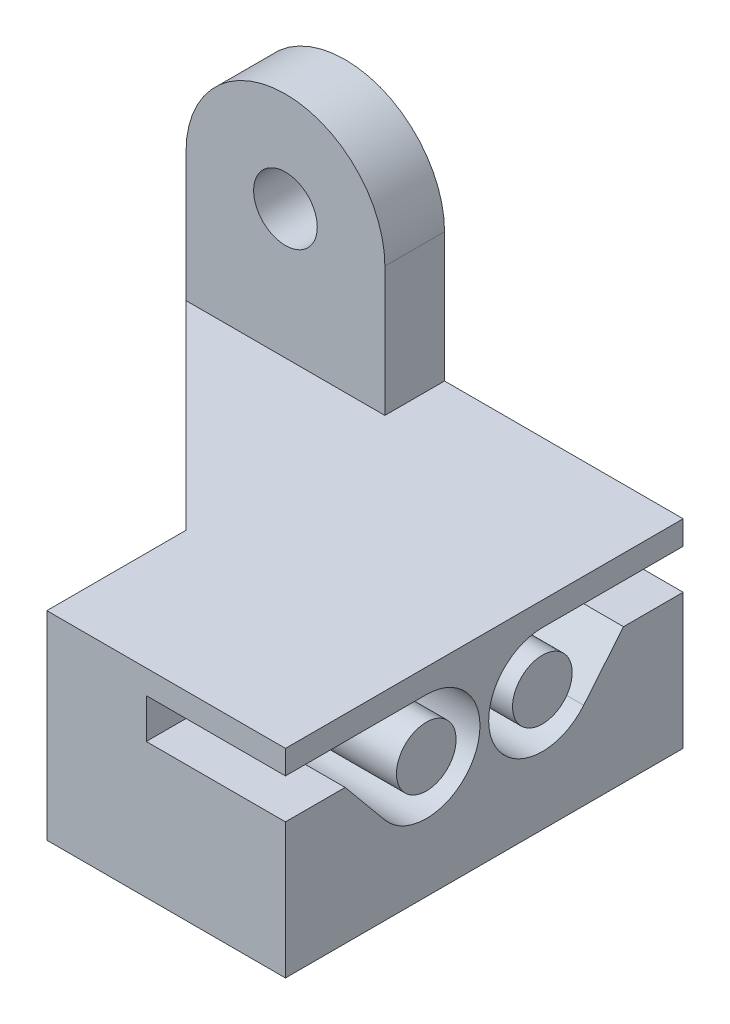
ISO-10303-21;
HEADER;
FILE_DESCRIPTION(('STEP AP214'),'2;1');
FILE_NAME('part.step','',(''),(''),'','','');
FILE_SCHEMA(('AUTOMOTIVE_DESIGN { 1 0 10303 214 1 1 1 1 }'));
ENDSEC;
DATA;
#1=APPLICATION_CONTEXT('core data for automotive mechanical design processes');
#2=APPLICATION_PROTOCOL_DEFINITION('international standard','automotive_design',2000,#1);
#3=PRODUCT_CONTEXT('',#1,'mechanical');
#4=PRODUCT('Part','Part','',(#3));
#5=PRODUCT_RELATED_PRODUCT_CATEGORY('part','',(#4));
#6=PRODUCT_DEFINITION_FORMATION('','',#4);
#7=PRODUCT_DEFINITION_CONTEXT('part definition',#1,'design');
#8=PRODUCT_DEFINITION('design','',#6,#7);
#9=PRODUCT_DEFINITION_SHAPE('','',#8);
#10=(LENGTH_UNIT() NAMED_UNIT(*) SI_UNIT(.MILLI.,.METRE.));
#11=(NAMED_UNIT(*) PLANE_ANGLE_UNIT() SI_UNIT($,.RADIAN.));
#12=(NAMED_UNIT(*) SI_UNIT($,.STERADIAN.) SOLID_ANGLE_UNIT());
#13=UNCERTAINTY_MEASURE_WITH_UNIT(LENGTH_MEASURE(1.E-05),#10,'distance_accuracy_value','');
#14=(GEOMETRIC_REPRESENTATION_CONTEXT(3) GLOBAL_UNCERTAINTY_ASSIGNED_CONTEXT((#13)) GLOBAL_UNIT_ASSIGNED_CONTEXT((#10,
#11,#12)) REPRESENTATION_CONTEXT('',''));
#15=CARTESIAN_POINT('',(0.,0.,0.));
#16=DIRECTION('',(0.,0.,1.));
#17=DIRECTION('',(1.,0.,0.));
#18=AXIS2_PLACEMENT_3D('',#15,#16,#17);
#19=CARTESIAN_POINT('',(0.,12.5,3.));
#20=DIRECTION('',(0.,0.,1.));
#21=DIRECTION('',(1.,0.,0.));
#22=AXIS2_PLACEMENT_3D('',#19,#20,#21);
#23=PLANE('',#22);
#24=CARTESIAN_POINT('',(0.,-12.5,3.));
#25=DIRECTION('',(0.,0.,1.));
#26=DIRECTION('',(1.,0.,0.));
#27=AXIS2_PLACEMENT_3D('',#24,#25,#26);
#28=CIRCLE('',#27,1.6);
#29=CARTESIAN_POINT('',(1.59999999999999,-12.5,3.));
#30=VERTEX_POINT('',#29);
#31=EDGE_CURVE('E276',#30,#30,#28,.T.);
#32=ORIENTED_EDGE('',*,*,#31,.F.);
#33=EDGE_LOOP('',(#32));
#34=FACE_BOUND('',#33,.T.);
#35=DIRECTION('',(0.,-1.,0.));
#36=VECTOR('',#35,1.);
#37=CARTESIAN_POINT('',(4.99999999999999,-18.1062696711217,3.));
#38=LINE('',#37,#36);
#39=CARTESIAN_POINT('',(4.99999999999999,-4.,3.));
#40=VERTEX_POINT('',#39);
#41=CARTESIAN_POINT('',(4.99999999999999,-12.5,3.));
#42=VERTEX_POINT('',#41);
#43=EDGE_CURVE('E269',#40,#42,#38,.T.);
#44=ORIENTED_EDGE('',*,*,#43,.F.);
#45=DIRECTION('',(-1.,0.,0.));
#46=VECTOR('',#45,1.);
#47=CARTESIAN_POINT('',(0.,-4.,3.));
#48=LINE('',#47,#46);
#49=CARTESIAN_POINT('',(-4.99999999999999,-4.,3.));
#50=VERTEX_POINT('',#49);
#51=EDGE_CURVE('E353',#40,#50,#48,.T.);
#52=ORIENTED_EDGE('',*,*,#51,.T.);
#53=DIRECTION('',(0.,1.,0.));
#54=VECTOR('',#53,1.);
#55=CARTESIAN_POINT('',(-4.99999999999999,-18.1062696711217,3.));
#56=LINE('',#55,#54);
#57=CARTESIAN_POINT('',(-4.99999999999999,-12.5,3.));
#58=VERTEX_POINT('',#57);
#59=EDGE_CURVE('E266',#58,#50,#56,.T.);
#60=ORIENTED_EDGE('',*,*,#59,.F.);
#61=CARTESIAN_POINT('',(0.,-12.5,3.));
#62=DIRECTION('',(0.,0.,1.));
#63=DIRECTION('',(1.,0.,0.));
#64=AXIS2_PLACEMENT_3D('',#61,#62,#63);
#65=CIRCLE('',#64,5.);
#66=EDGE_CURVE('E279',#58,#42,#65,.T.);
#67=ORIENTED_EDGE('',*,*,#66,.T.);
#68=EDGE_LOOP('',(#44,#52,#60,#67));
#69=FACE_BOUND('',#68,.T.);
#70=ADVANCED_FACE('F34',(#34,#69),#23,.T.);
#71=CARTESIAN_POINT('',(0.,12.5,20.));
#72=DIRECTION('',(0.,0.,-1.));
#73=DIRECTION('',(-1.,0.,0.));
#74=AXIS2_PLACEMENT_3D('',#71,#72,#73);
#75=CYLINDRICAL_SURFACE('',#74,5.);
#76=CARTESIAN_POINT('',(0.,12.5,3.));
#77=DIRECTION('',(0.,0.,1.));
#78=DIRECTION('',(1.,0.,0.));
#79=AXIS2_PLACEMENT_3D('',#76,#77,#78);
#80=CIRCLE('',#79,5.);
#81=CARTESIAN_POINT('',(4.99999999999999,12.5,3.));
#82=VERTEX_POINT('',#81);
#83=CARTESIAN_POINT('',(-4.99999999999999,12.5,3.));
#84=VERTEX_POINT('',#83);
#85=EDGE_CURVE('E282',#82,#84,#80,.T.);
#86=ORIENTED_EDGE('',*,*,#85,.F.);
#87=DIRECTION('',(0.,0.,-1.));
#88=VECTOR('',#87,1.);
#89=CARTESIAN_POINT('',(5.,12.5,20.));
#90=LINE('',#89,#88);
#91=CARTESIAN_POINT('',(5.,12.5,0.));
#92=VERTEX_POINT('',#91);
#93=EDGE_CURVE('E302',#82,#92,#90,.T.);
#94=ORIENTED_EDGE('',*,*,#93,.T.);
#95=CARTESIAN_POINT('',(0.,12.5,0.));
#96=DIRECTION('',(0.,0.,1.));
#97=DIRECTION('',(1.,0.,0.));
#98=AXIS2_PLACEMENT_3D('',#95,#96,#97);
#99=CIRCLE('',#98,5.);
#100=CARTESIAN_POINT('',(-5.,12.5,0.));
#101=VERTEX_POINT('',#100);
#102=EDGE_CURVE('E291',#92,#101,#99,.T.);
#103=ORIENTED_EDGE('',*,*,#102,.T.);
#104=DIRECTION('',(0.,0.,-1.));
#105=VECTOR('',#104,1.);
#106=CARTESIAN_POINT('',(-5.,12.5,20.));
#107=LINE('',#106,#105);
#108=EDGE_CURVE('E344',#84,#101,#107,.T.);
#109=ORIENTED_EDGE('',*,*,#108,.F.);
#110=EDGE_LOOP('',(#86,#94,#103,#109));
#111=FACE_BOUND('',#110,.T.);
#112=ADVANCED_FACE('F379',(#111),#75,.T.);
#113=CARTESIAN_POINT('',(-5.,12.5,20.));
#114=DIRECTION('',(1.,0.,0.));
#115=DIRECTION('',(0.,1.,0.));
#116=AXIS2_PLACEMENT_3D('',#113,#114,#115);
#117=PLANE('',#116);
#118=ORIENTED_EDGE('',*,*,#59,.T.);
#119=CARTESIAN_POINT('',(-4.99999999999999,6.,3.));
#120=VERTEX_POINT('',#119);
#121=EDGE_CURVE('E270',#50,#120,#56,.T.);
#122=ORIENTED_EDGE('',*,*,#121,.T.);
#123=EDGE_CURVE('E271',#120,#84,#56,.T.);
#124=ORIENTED_EDGE('',*,*,#123,.T.);
#125=ORIENTED_EDGE('',*,*,#108,.T.);
#126=DIRECTION('',(0.,-1.,0.));
#127=VECTOR('',#126,1.);
#128=CARTESIAN_POINT('',(-5.,12.5,0.));
#129=LINE('',#128,#127);
#130=CARTESIAN_POINT('',(-5.00000000000001,-12.5,0.));
#131=VERTEX_POINT('',#130);
#132=EDGE_CURVE('E305',#101,#131,#129,.T.);
#133=ORIENTED_EDGE('',*,*,#132,.T.);
#134=DIRECTION('',(0.,0.,-1.));
#135=VECTOR('',#134,1.);
#136=CARTESIAN_POINT('',(-5.00000000000001,-12.5,20.));
#137=LINE('',#136,#135);
#138=EDGE_CURVE('E342',#58,#131,#137,.T.);
#139=ORIENTED_EDGE('',*,*,#138,.F.);
#140=EDGE_LOOP('',(#118,#122,#124,#125,#133,#139));
#141=FACE_BOUND('',#140,.T.);
#142=ADVANCED_FACE('F368',(#141),#117,.F.);
#143=CARTESIAN_POINT('',(0.,-12.5,20.));
#144=DIRECTION('',(0.,0.,-1.));
#145=DIRECTION('',(-1.,0.,0.));
#146=AXIS2_PLACEMENT_3D('',#143,#144,#145);
#147=CYLINDRICAL_SURFACE('',#146,5.);
#148=ORIENTED_EDGE('',*,*,#66,.F.);
#149=ORIENTED_EDGE('',*,*,#138,.T.);
#150=CARTESIAN_POINT('',(0.,-12.5,0.));
#151=DIRECTION('',(0.,0.,1.));
#152=DIRECTION('',(1.,0.,0.));
#153=AXIS2_PLACEMENT_3D('',#150,#151,#152);
#154=CIRCLE('',#153,5.);
#155=CARTESIAN_POINT('',(5.,-12.5,0.));
#156=VERTEX_POINT('',#155);
#157=EDGE_CURVE('E308',#131,#156,#154,.T.);
#158=ORIENTED_EDGE('',*,*,#157,.T.);
#159=DIRECTION('',(0.,0.,-1.));
#160=VECTOR('',#159,1.);
#161=CARTESIAN_POINT('',(5.,-12.5,20.));
#162=LINE('',#161,#160);
#163=EDGE_CURVE('E340',#42,#156,#162,.T.);
#164=ORIENTED_EDGE('',*,*,#163,.F.);
#165=EDGE_LOOP('',(#148,#149,#158,#164));
#166=FACE_BOUND('',#165,.T.);
#167=ADVANCED_FACE('F392',(#166),#147,.T.);
#168=CARTESIAN_POINT('',(4.99999999999999,-4.,20.));
#169=DIRECTION('',(-1.,0.,0.));
#170=DIRECTION('',(0.,-1.,0.));
#171=AXIS2_PLACEMENT_3D('',#168,#169,#170);
#172=PLANE('',#171);
#173=ORIENTED_EDGE('',*,*,#43,.T.);
#174=ORIENTED_EDGE('',*,*,#163,.T.);
#175=DIRECTION('',(0.,1.,0.));
#176=VECTOR('',#175,1.);
#177=CARTESIAN_POINT('',(4.99999999999999,-4.,0.));
#178=LINE('',#177,#176);
#179=CARTESIAN_POINT('',(4.99999999999999,-4.,0.));
#180=VERTEX_POINT('',#179);
#181=EDGE_CURVE('E311',#156,#180,#178,.T.);
#182=ORIENTED_EDGE('',*,*,#181,.T.);
#183=DIRECTION('',(0.,0.,-1.));
#184=VECTOR('',#183,1.);
#185=CARTESIAN_POINT('',(4.99999999999999,-4.,20.));
#186=LINE('',#185,#184);
#187=EDGE_CURVE('E336',#40,#180,#186,.T.);
#188=ORIENTED_EDGE('',*,*,#187,.F.);
#189=EDGE_LOOP('',(#173,#174,#182,#188));
#190=FACE_BOUND('',#189,.T.);
#191=ADVANCED_FACE('F394',(#190),#172,.F.);
#192=CARTESIAN_POINT('',(5.,12.5,20.));
#193=DIRECTION('',(-1.,0.,0.));
#194=DIRECTION('',(0.,-1.,0.));
#195=AXIS2_PLACEMENT_3D('',#192,#193,#194);
#196=PLANE('',#195);
#197=CARTESIAN_POINT('',(4.99999999999999,6.,3.));
#198=VERTEX_POINT('',#197);
#199=EDGE_CURVE('E274',#82,#198,#38,.T.);
#200=ORIENTED_EDGE('',*,*,#199,.T.);
#201=DIRECTION('',(0.,0.,-1.));
#202=VECTOR('',#201,1.);
#203=CARTESIAN_POINT('',(4.99999999999999,6.,20.));
#204=LINE('',#203,#202);
#205=CARTESIAN_POINT('',(4.99999999999999,6.,0.));
#206=VERTEX_POINT('',#205);
#207=EDGE_CURVE('E326',#198,#206,#204,.T.);
#208=ORIENTED_EDGE('',*,*,#207,.T.);
#209=DIRECTION('',(0.,1.,0.));
#210=VECTOR('',#209,1.);
#211=CARTESIAN_POINT('',(5.,12.5,0.));
#212=LINE('',#211,#210);
#213=EDGE_CURVE('E295',#206,#92,#212,.T.);
#214=ORIENTED_EDGE('',*,*,#213,.T.);
#215=ORIENTED_EDGE('',*,*,#93,.F.);
#216=EDGE_LOOP('',(#200,#208,#214,#215));
#217=FACE_BOUND('',#216,.T.);
#218=ADVANCED_FACE('F459',(#217),#196,.F.);
#219=CARTESIAN_POINT('',(0.,-12.5,20.));
#220=DIRECTION('',(0.,0.,-1.));
#221=DIRECTION('',(-1.,0.,0.));
#222=AXIS2_PLACEMENT_3D('',#219,#220,#221);
#223=CYLINDRICAL_SURFACE('',#222,1.6);
#224=CARTESIAN_POINT('',(0.,-12.5,0.));
#225=DIRECTION('',(0.,0.,1.));
#226=DIRECTION('',(1.,0.,0.));
#227=AXIS2_PLACEMENT_3D('',#224,#225,#226);
#228=CIRCLE('',#227,1.6);
#229=CARTESIAN_POINT('',(1.59999999999999,-12.5,0.));
#230=VERTEX_POINT('',#229);
#231=EDGE_CURVE('E288',#230,#230,#228,.T.);
#232=ORIENTED_EDGE('',*,*,#231,.F.);
#233=EDGE_LOOP('',(#232));
#234=FACE_BOUND('',#233,.T.);
#235=ORIENTED_EDGE('',*,*,#31,.T.);
#236=EDGE_LOOP('',(#235));
#237=FACE_BOUND('',#236,.T.);
#238=ADVANCED_FACE('F450',(#234,#237),#223,.F.);
#239=CARTESIAN_POINT('',(0.,12.5,20.));
#240=DIRECTION('',(0.,0.,-1.));
#241=DIRECTION('',(-1.,0.,0.));
#242=AXIS2_PLACEMENT_3D('',#239,#240,#241);
#243=CYLINDRICAL_SURFACE('',#242,1.6);
#244=CARTESIAN_POINT('',(0.,12.5,0.));
#245=DIRECTION('',(0.,0.,1.));
#246=DIRECTION('',(1.,0.,0.));
#247=AXIS2_PLACEMENT_3D('',#244,#245,#246);
#248=CIRCLE('',#247,1.6);
#249=CARTESIAN_POINT('',(1.59999999999999,12.5,0.));
#250=VERTEX_POINT('',#249);
#251=EDGE_CURVE('E285',#250,#250,#248,.T.);
#252=ORIENTED_EDGE('',*,*,#251,.F.);
#253=EDGE_LOOP('',(#252));
#254=FACE_BOUND('',#253,.T.);
#255=CARTESIAN_POINT('',(0.,12.5,3.));
#256=DIRECTION('',(0.,0.,1.));
#257=DIRECTION('',(1.,0.,0.));
#258=AXIS2_PLACEMENT_3D('',#255,#256,#257);
#259=CIRCLE('',#258,1.6);
#260=CARTESIAN_POINT('',(1.59999999999999,12.5,3.));
#261=VERTEX_POINT('',#260);
#262=EDGE_CURVE('E280',#261,#261,#259,.T.);
#263=ORIENTED_EDGE('',*,*,#262,.T.);
#264=EDGE_LOOP('',(#263));
#265=FACE_BOUND('',#264,.T.);
#266=ADVANCED_FACE('F447',(#254,#265),#243,.F.);
#267=CARTESIAN_POINT('',(0.,12.5,20.));
#268=DIRECTION('',(0.,0.,1.));
#269=DIRECTION('',(1.,0.,0.));
#270=AXIS2_PLACEMENT_3D('',#267,#268,#269);
#271=PLANE('',#270);
#272=DIRECTION('',(1.,0.,0.));
#273=VECTOR('',#272,1.);
#274=CARTESIAN_POINT('',(9.99999999999999,2.8,20.));
#275=LINE('',#274,#273);
#276=CARTESIAN_POINT('',(9.99999999999999,2.8,20.));
#277=VERTEX_POINT('',#276);
#278=CARTESIAN_POINT('',(17.,2.8,20.));
#279=VERTEX_POINT('',#278);
#280=EDGE_CURVE('E222',#277,#279,#275,.T.);
#281=ORIENTED_EDGE('',*,*,#280,.F.);
#282=DIRECTION('',(0.,-1.,0.));
#283=VECTOR('',#282,1.);
#284=CARTESIAN_POINT('',(9.99999999999999,4.8,20.));
#285=LINE('',#284,#283);
#286=CARTESIAN_POINT('',(9.99999999999999,4.8,20.));
#287=VERTEX_POINT('',#286);
#288=EDGE_CURVE('E193',#287,#277,#285,.T.);
#289=ORIENTED_EDGE('',*,*,#288,.F.);
#290=DIRECTION('',(1.,0.,0.));
#291=VECTOR('',#290,1.);
#292=CARTESIAN_POINT('',(9.99999999999999,4.8,20.));
#293=LINE('',#292,#291);
#294=CARTESIAN_POINT('',(17.,4.8,20.));
#295=VERTEX_POINT('',#294);
#296=EDGE_CURVE('E183',#287,#295,#293,.T.);
#297=ORIENTED_EDGE('',*,*,#296,.T.);
#298=DIRECTION('',(0.,1.,0.));
#299=VECTOR('',#298,1.);
#300=CARTESIAN_POINT('',(17.,-4.,20.));
#301=LINE('',#300,#299);
#302=CARTESIAN_POINT('',(17.,6.,20.));
#303=VERTEX_POINT('',#302);
#304=EDGE_CURVE('E294',#295,#303,#301,.T.);
#305=ORIENTED_EDGE('',*,*,#304,.T.);
#306=DIRECTION('',(-1.,0.,0.));
#307=VECTOR('',#306,1.);
#308=CARTESIAN_POINT('',(17.,6.,20.));
#309=LINE('',#308,#307);
#310=CARTESIAN_POINT('',(4.99999999999999,6.,20.));
#311=VERTEX_POINT('',#310);
#312=EDGE_CURVE('E299',#303,#311,#309,.T.);
#313=ORIENTED_EDGE('',*,*,#312,.T.);
#314=DIRECTION('',(0.,1.,0.));
#315=VECTOR('',#314,1.);
#316=CARTESIAN_POINT('',(4.99999999999999,-18.1062696711217,20.));
#317=LINE('',#316,#315);
#318=CARTESIAN_POINT('',(4.99999999999999,-4.,20.));
#319=VERTEX_POINT('',#318);
#320=EDGE_CURVE('E258',#319,#311,#317,.T.);
#321=ORIENTED_EDGE('',*,*,#320,.F.);
#322=DIRECTION('',(1.,0.,0.));
#323=VECTOR('',#322,1.);
#324=CARTESIAN_POINT('',(4.99999999999999,-4.,20.));
#325=LINE('',#324,#323);
#326=CARTESIAN_POINT('',(17.,-4.,20.));
#327=VERTEX_POINT('',#326);
#328=EDGE_CURVE('E292',#319,#327,#325,.T.);
#329=ORIENTED_EDGE('',*,*,#328,.T.);
#330=EDGE_CURVE('E296',#327,#279,#301,.T.);
#331=ORIENTED_EDGE('',*,*,#330,.T.);
#332=EDGE_LOOP('',(#281,#289,#297,#305,#313,#321,#329,#331));
#333=FACE_BOUND('',#332,.T.);
#334=ADVANCED_FACE('F449',(#333),#271,.T.);
#335=CARTESIAN_POINT('',(0.,12.5,0.));
#336=DIRECTION('',(0.,0.,1.));
#337=DIRECTION('',(1.,0.,0.));
#338=AXIS2_PLACEMENT_3D('',#335,#336,#337);
#339=PLANE('',#338);
#340=DIRECTION('',(0.,1.,0.));
#341=VECTOR('',#340,1.);
#342=CARTESIAN_POINT('',(9.99999999999999,4.8,0.));
#343=LINE('',#342,#341);
#344=CARTESIAN_POINT('',(9.99999999999999,2.8,0.));
#345=VERTEX_POINT('',#344);
#346=CARTESIAN_POINT('',(9.99999999999999,4.8,0.));
#347=VERTEX_POINT('',#346);
#348=EDGE_CURVE('E231',#345,#347,#343,.T.);
#349=ORIENTED_EDGE('',*,*,#348,.F.);
#350=DIRECTION('',(1.,0.,0.));
#351=VECTOR('',#350,1.);
#352=CARTESIAN_POINT('',(9.99999999999999,2.8,0.));
#353=LINE('',#352,#351);
#354=CARTESIAN_POINT('',(17.,2.8,0.));
#355=VERTEX_POINT('',#354);
#356=EDGE_CURVE('E255',#345,#355,#353,.T.);
#357=ORIENTED_EDGE('',*,*,#356,.T.);
#358=DIRECTION('',(0.,1.,0.));
#359=VECTOR('',#358,1.);
#360=CARTESIAN_POINT('',(17.,-4.,0.));
#361=LINE('',#360,#359);
#362=CARTESIAN_POINT('',(17.,-4.,0.));
#363=VERTEX_POINT('',#362);
#364=EDGE_CURVE('E317',#363,#355,#361,.T.);
#365=ORIENTED_EDGE('',*,*,#364,.F.);
#366=DIRECTION('',(1.,0.,0.));
#367=VECTOR('',#366,1.);
#368=CARTESIAN_POINT('',(4.99999999999999,-4.,0.));
#369=LINE('',#368,#367);
#370=EDGE_CURVE('E314',#180,#363,#369,.T.);
#371=ORIENTED_EDGE('',*,*,#370,.F.);
#372=ORIENTED_EDGE('',*,*,#181,.F.);
#373=ORIENTED_EDGE('',*,*,#157,.F.);
#374=ORIENTED_EDGE('',*,*,#132,.F.);
#375=ORIENTED_EDGE('',*,*,#102,.F.);
#376=ORIENTED_EDGE('',*,*,#213,.F.);
#377=DIRECTION('',(-1.,0.,0.));
#378=VECTOR('',#377,1.);
#379=CARTESIAN_POINT('',(17.,6.,0.));
#380=LINE('',#379,#378);
#381=CARTESIAN_POINT('',(17.,6.,0.));
#382=VERTEX_POINT('',#381);
#383=EDGE_CURVE('E320',#382,#206,#380,.T.);
#384=ORIENTED_EDGE('',*,*,#383,.F.);
#385=CARTESIAN_POINT('',(17.,4.8,0.));
#386=VERTEX_POINT('',#385);
#387=EDGE_CURVE('E316',#386,#382,#361,.T.);
#388=ORIENTED_EDGE('',*,*,#387,.F.);
#389=DIRECTION('',(1.,0.,0.));
#390=VECTOR('',#389,1.);
#391=CARTESIAN_POINT('',(9.99999999999999,4.8,0.));
#392=LINE('',#391,#390);
#393=EDGE_CURVE('E57',#347,#386,#392,.T.);
#394=ORIENTED_EDGE('',*,*,#393,.F.);
#395=EDGE_LOOP('',(#349,#357,#365,#371,#372,#373,#374,#375,#376,#384,#388,#394));
#396=FACE_BOUND('',#395,.T.);
#397=ORIENTED_EDGE('',*,*,#231,.T.);
#398=EDGE_LOOP('',(#397));
#399=FACE_BOUND('',#398,.T.);
#400=ORIENTED_EDGE('',*,*,#251,.T.);
#401=EDGE_LOOP('',(#400));
#402=FACE_BOUND('',#401,.T.);
#403=ADVANCED_FACE('F384',(#396,#399,#402),#339,.F.);
#404=CARTESIAN_POINT('',(4.99999999999999,-4.,20.));
#405=DIRECTION('',(0.,1.,0.));
#406=DIRECTION('',(0.,0.,1.));
#407=AXIS2_PLACEMENT_3D('',#404,#405,#406);
#408=PLANE('',#407);
#409=ORIENTED_EDGE('',*,*,#370,.T.);
#410=DIRECTION('',(0.,0.,-1.));
#411=VECTOR('',#410,1.);
#412=CARTESIAN_POINT('',(17.,-4.,20.));
#413=LINE('',#412,#411);
#414=EDGE_CURVE('E333',#327,#363,#413,.T.);
#415=ORIENTED_EDGE('',*,*,#414,.F.);
#416=ORIENTED_EDGE('',*,*,#328,.F.);
#417=CARTESIAN_POINT('',(4.99999999999999,-4.,13.0000000000001));
#418=VERTEX_POINT('',#417);
#419=EDGE_CURVE('E337',#319,#418,#186,.T.);
#420=ORIENTED_EDGE('',*,*,#419,.T.);
#421=DIRECTION('',(-0.707106781186544,0.,-0.707106781186552));
#422=VECTOR('',#421,1.);
#423=CARTESIAN_POINT('',(8.49999999999996,-4.,16.5000000000001));
#424=LINE('',#423,#422);
#425=EDGE_CURVE('E42',#418,#50,#424,.T.);
#426=ORIENTED_EDGE('',*,*,#425,.T.);
#427=ORIENTED_EDGE('',*,*,#51,.F.);
#428=ORIENTED_EDGE('',*,*,#187,.T.);
#429=EDGE_LOOP('',(#409,#415,#416,#420,#426,#427,#428));
#430=FACE_BOUND('',#429,.T.);
#431=ADVANCED_FACE('F356',(#430),#408,.F.);
#432=CARTESIAN_POINT('',(17.,-4.,20.));
#433=DIRECTION('',(-1.,0.,0.));
#434=DIRECTION('',(0.,0.,1.));
#435=AXIS2_PLACEMENT_3D('',#432,#433,#434);
#436=PLANE('',#435);
#437=DIRECTION('',(0.,-0.770827950138104,-0.637043382577583));
#438=VECTOR('',#437,1.);
#439=CARTESIAN_POINT('',(17.,0.379982867040524,15.));
#440=LINE('',#439,#438);
#441=CARTESIAN_POINT('',(17.,2.8,17.));
#442=VERTEX_POINT('',#441);
#443=CARTESIAN_POINT('',(17.,0.379982867040524,15.));
#444=VERTEX_POINT('',#443);
#445=EDGE_CURVE('E198',#442,#444,#440,.T.);
#446=ORIENTED_EDGE('',*,*,#445,.F.);
#447=DIRECTION('',(0.,0.,-1.));
#448=VECTOR('',#447,1.);
#449=CARTESIAN_POINT('',(17.,2.8,17.));
#450=LINE('',#449,#448);
#451=EDGE_CURVE('E201',#279,#442,#450,.T.);
#452=ORIENTED_EDGE('',*,*,#451,.F.);
#453=ORIENTED_EDGE('',*,*,#330,.F.);
#454=ORIENTED_EDGE('',*,*,#414,.T.);
#455=ORIENTED_EDGE('',*,*,#364,.T.);
#456=DIRECTION('',(0.,0.,-1.));
#457=VECTOR('',#456,1.);
#458=CARTESIAN_POINT('',(17.,2.8,3.));
#459=LINE('',#458,#457);
#460=CARTESIAN_POINT('',(17.,2.8,3.));
#461=VERTEX_POINT('',#460);
#462=EDGE_CURVE('E235',#461,#355,#459,.T.);
#463=ORIENTED_EDGE('',*,*,#462,.F.);
#464=DIRECTION('',(0.,0.770827950138104,-0.637043382577583));
#465=VECTOR('',#464,1.);
#466=CARTESIAN_POINT('',(17.,0.379982867040525,5.));
#467=LINE('',#466,#465);
#468=CARTESIAN_POINT('',(17.,0.379982867040526,5.));
#469=VERTEX_POINT('',#468);
#470=EDGE_CURVE('E251',#469,#461,#467,.T.);
#471=ORIENTED_EDGE('',*,*,#470,.F.);
#472=CARTESIAN_POINT('',(17.,2.1,7.08123546537288));
#473=DIRECTION('',(1.,0.,0.));
#474=DIRECTION('',(0.,0.,-1.));
#475=AXIS2_PLACEMENT_3D('',#472,#473,#474);
#476=CIRCLE('',#475,2.7);
#477=CARTESIAN_POINT('',(17.,4.8,7.08123546537288));
#478=VERTEX_POINT('',#477);
#479=EDGE_CURVE('E248',#478,#469,#476,.T.);
#480=ORIENTED_EDGE('',*,*,#479,.F.);
#481=DIRECTION('',(0.,0.,1.));
#482=VECTOR('',#481,1.);
#483=CARTESIAN_POINT('',(17.,4.8,0.));
#484=LINE('',#483,#482);
#485=EDGE_CURVE('E228',#386,#478,#484,.T.);
#486=ORIENTED_EDGE('',*,*,#485,.F.);
#487=ORIENTED_EDGE('',*,*,#387,.T.);
#488=DIRECTION('',(0.,0.,-1.));
#489=VECTOR('',#488,1.);
#490=CARTESIAN_POINT('',(17.,6.,20.));
#491=LINE('',#490,#489);
#492=EDGE_CURVE('E330',#303,#382,#491,.T.);
#493=ORIENTED_EDGE('',*,*,#492,.F.);
#494=ORIENTED_EDGE('',*,*,#304,.F.);
#495=DIRECTION('',(0.,0.,1.));
#496=VECTOR('',#495,1.);
#497=CARTESIAN_POINT('',(17.,4.8,20.));
#498=LINE('',#497,#496);
#499=CARTESIAN_POINT('',(17.,4.8,12.9187645346271));
#500=VERTEX_POINT('',#499);
#501=EDGE_CURVE('E212',#500,#295,#498,.T.);
#502=ORIENTED_EDGE('',*,*,#501,.F.);
#503=CARTESIAN_POINT('',(17.,2.1,12.9187645346271));
#504=DIRECTION('',(1.,0.,0.));
#505=DIRECTION('',(0.,0.,1.));
#506=AXIS2_PLACEMENT_3D('',#503,#504,#505);
#507=CIRCLE('',#506,2.7);
#508=EDGE_CURVE('E49',#444,#500,#507,.T.);
#509=ORIENTED_EDGE('',*,*,#508,.F.);
#510=EDGE_LOOP('',(#446,#452,#453,#454,#455,#463,#471,#480,#486,#487,#493,#494,#502,#509));
#511=FACE_BOUND('',#510,.T.);
#512=ADVANCED_FACE('F400',(#511),#436,.F.);
#513=CARTESIAN_POINT('',(17.,6.,20.));
#514=DIRECTION('',(0.,-1.,0.));
#515=DIRECTION('',(1.,0.,0.));
#516=AXIS2_PLACEMENT_3D('',#513,#514,#515);
#517=PLANE('',#516);
#518=ORIENTED_EDGE('',*,*,#383,.T.);
#519=ORIENTED_EDGE('',*,*,#207,.F.);
#520=DIRECTION('',(1.,0.,0.));
#521=VECTOR('',#520,1.);
#522=CARTESIAN_POINT('',(0.,6.,3.));
#523=LINE('',#522,#521);
#524=EDGE_CURVE('E351',#120,#198,#523,.T.);
#525=ORIENTED_EDGE('',*,*,#524,.F.);
#526=DIRECTION('',(0.707106781186544,0.,0.707106781186552));
#527=VECTOR('',#526,1.);
#528=CARTESIAN_POINT('',(14.4999999999999,6.,22.5000000000001));
#529=LINE('',#528,#527);
#530=CARTESIAN_POINT('',(4.99999999999999,6.,13.0000000000001));
#531=VERTEX_POINT('',#530);
#532=EDGE_CURVE('E12',#120,#531,#529,.T.);
#533=ORIENTED_EDGE('',*,*,#532,.T.);
#534=EDGE_CURVE('E327',#311,#531,#204,.T.);
#535=ORIENTED_EDGE('',*,*,#534,.F.);
#536=ORIENTED_EDGE('',*,*,#312,.F.);
#537=ORIENTED_EDGE('',*,*,#492,.T.);
#538=EDGE_LOOP('',(#518,#519,#525,#533,#535,#536,#537));
#539=FACE_BOUND('',#538,.T.);
#540=ADVANCED_FACE('F443',(#539),#517,.F.);
#541=CARTESIAN_POINT('',(4.99999999999999,-18.1062696711217,-37.567911914472));
#542=DIRECTION('',(1.,0.,0.));
#543=DIRECTION('',(0.,0.,-1.));
#544=AXIS2_PLACEMENT_3D('',#541,#542,#543);
#545=PLANE('',#544);
#546=ORIENTED_EDGE('',*,*,#534,.T.);
#547=DIRECTION('',(0.,-1.,0.));
#548=VECTOR('',#547,1.);
#549=CARTESIAN_POINT('',(4.99999999999999,-18.1062696711217,13.0000000000001));
#550=LINE('',#549,#548);
#551=EDGE_CURVE('E346',#531,#418,#550,.T.);
#552=ORIENTED_EDGE('',*,*,#551,.T.);
#553=ORIENTED_EDGE('',*,*,#419,.F.);
#554=ORIENTED_EDGE('',*,*,#320,.T.);
#555=EDGE_LOOP('',(#546,#552,#553,#554));
#556=FACE_BOUND('',#555,.T.);
#557=ADVANCED_FACE('F437',(#556),#545,.F.);
#558=ORIENTED_EDGE('',*,*,#262,.F.);
#559=EDGE_LOOP('',(#558));
#560=FACE_BOUND('',#559,.T.);
#561=ORIENTED_EDGE('',*,*,#123,.F.);
#562=ORIENTED_EDGE('',*,*,#524,.T.);
#563=ORIENTED_EDGE('',*,*,#199,.F.);
#564=ORIENTED_EDGE('',*,*,#85,.T.);
#565=EDGE_LOOP('',(#561,#562,#563,#564));
#566=FACE_BOUND('',#565,.T.);
#567=ADVANCED_FACE('F375',(#560,#566),#23,.T.);
#568=CARTESIAN_POINT('',(4.99999999999999,-18.1062696711217,13.0000000000001));
#569=DIRECTION('',(0.707106781186552,0.,-0.707106781186544));
#570=DIRECTION('',(0.,-1.,0.));
#571=AXIS2_PLACEMENT_3D('',#568,#569,#570);
#572=PLANE('',#571);
#573=ORIENTED_EDGE('',*,*,#532,.F.);
#574=ORIENTED_EDGE('',*,*,#121,.F.);
#575=ORIENTED_EDGE('',*,*,#425,.F.);
#576=ORIENTED_EDGE('',*,*,#551,.F.);
#577=EDGE_LOOP('',(#573,#574,#575,#576));
#578=FACE_BOUND('',#577,.T.);
#579=ADVANCED_FACE('F36',(#578),#572,.F.);
#580=CARTESIAN_POINT('',(9.99999999999999,2.8,3.));
#581=DIRECTION('',(0.,-1.,0.));
#582=DIRECTION('',(0.,0.,-1.));
#583=AXIS2_PLACEMENT_3D('',#580,#581,#582);
#584=PLANE('',#583);
#585=ORIENTED_EDGE('',*,*,#462,.T.);
#586=ORIENTED_EDGE('',*,*,#356,.F.);
#587=DIRECTION('',(0.,0.,-1.));
#588=VECTOR('',#587,1.);
#589=CARTESIAN_POINT('',(9.99999999999999,2.8,3.));
#590=LINE('',#589,#588);
#591=CARTESIAN_POINT('',(9.99999999999999,2.8,3.));
#592=VERTEX_POINT('',#591);
#593=EDGE_CURVE('E244',#592,#345,#590,.T.);
#594=ORIENTED_EDGE('',*,*,#593,.F.);
#595=DIRECTION('',(1.,0.,0.));
#596=VECTOR('',#595,1.);
#597=CARTESIAN_POINT('',(9.99999999999999,2.8,3.));
#598=LINE('',#597,#596);
#599=EDGE_CURVE('E259',#592,#461,#598,.T.);
#600=ORIENTED_EDGE('',*,*,#599,.T.);
#601=EDGE_LOOP('',(#585,#586,#594,#600));
#602=FACE_BOUND('',#601,.T.);
#603=ADVANCED_FACE('F405',(#602),#584,.F.);
#604=CARTESIAN_POINT('',(9.99999999999999,0.379982867040525,5.));
#605=DIRECTION('',(0.,-0.637043382577583,-0.770827950138104));
#606=DIRECTION('',(0.,0.770827950138104,-0.637043382577583));
#607=AXIS2_PLACEMENT_3D('',#604,#605,#606);
#608=PLANE('',#607);
#609=ORIENTED_EDGE('',*,*,#470,.T.);
#610=ORIENTED_EDGE('',*,*,#599,.F.);
#611=DIRECTION('',(0.,0.770827950138104,-0.637043382577583));
#612=VECTOR('',#611,1.);
#613=CARTESIAN_POINT('',(9.99999999999999,0.379982867040525,5.));
#614=LINE('',#613,#612);
#615=CARTESIAN_POINT('',(9.99999999999999,0.379982867040526,5.));
#616=VERTEX_POINT('',#615);
#617=EDGE_CURVE('E241',#616,#592,#614,.T.);
#618=ORIENTED_EDGE('',*,*,#617,.F.);
#619=DIRECTION('',(1.,0.,0.));
#620=VECTOR('',#619,1.);
#621=CARTESIAN_POINT('',(9.99999999999999,0.379982867040526,5.));
#622=LINE('',#621,#620);
#623=EDGE_CURVE('E261',#616,#469,#622,.T.);
#624=ORIENTED_EDGE('',*,*,#623,.T.);
#625=EDGE_LOOP('',(#609,#610,#618,#624));
#626=FACE_BOUND('',#625,.T.);
#627=ADVANCED_FACE('F411',(#626),#608,.F.);
#628=CARTESIAN_POINT('',(9.99999999999999,2.1,7.08123546537288));
#629=DIRECTION('',(1.,0.,0.));
#630=DIRECTION('',(0.,0.,-1.));
#631=AXIS2_PLACEMENT_3D('',#628,#629,#630);
#632=CYLINDRICAL_SURFACE('',#631,2.7);
#633=ORIENTED_EDGE('',*,*,#479,.T.);
#634=ORIENTED_EDGE('',*,*,#623,.F.);
#635=CARTESIAN_POINT('',(9.99999999999999,2.1,7.08123546537288));
#636=DIRECTION('',(1.,0.,0.));
#637=DIRECTION('',(0.,0.,-1.));
#638=AXIS2_PLACEMENT_3D('',#635,#636,#637);
#639=CIRCLE('',#638,2.7);
#640=CARTESIAN_POINT('',(9.99999999999999,4.8,7.08123546537288));
#641=VERTEX_POINT('',#640);
#642=EDGE_CURVE('E238',#641,#616,#639,.T.);
#643=ORIENTED_EDGE('',*,*,#642,.F.);
#644=DIRECTION('',(1.,0.,0.));
#645=VECTOR('',#644,1.);
#646=CARTESIAN_POINT('',(9.99999999999999,4.8,7.08123546537288));
#647=LINE('',#646,#645);
#648=EDGE_CURVE('E263',#641,#478,#647,.T.);
#649=ORIENTED_EDGE('',*,*,#648,.T.);
#650=EDGE_LOOP('',(#633,#634,#643,#649));
#651=FACE_BOUND('',#650,.T.);
#652=ADVANCED_FACE('F416',(#651),#632,.F.);
#653=CARTESIAN_POINT('',(9.99999999999999,4.8,0.));
#654=DIRECTION('',(0.,1.,0.));
#655=DIRECTION('',(0.,0.,1.));
#656=AXIS2_PLACEMENT_3D('',#653,#654,#655);
#657=PLANE('',#656);
#658=ORIENTED_EDGE('',*,*,#485,.T.);
#659=ORIENTED_EDGE('',*,*,#648,.F.);
#660=DIRECTION('',(0.,0.,1.));
#661=VECTOR('',#660,1.);
#662=CARTESIAN_POINT('',(9.99999999999999,4.8,0.));
#663=LINE('',#662,#661);
#664=EDGE_CURVE('E234',#347,#641,#663,.T.);
#665=ORIENTED_EDGE('',*,*,#664,.F.);
#666=ORIENTED_EDGE('',*,*,#393,.T.);
#667=EDGE_LOOP('',(#658,#659,#665,#666));
#668=FACE_BOUND('',#667,.T.);
#669=ADVANCED_FACE('F417',(#668),#657,.F.);
#670=CARTESIAN_POINT('',(9.99999999999999,2.1,7.08123546537288));
#671=DIRECTION('',(1.,0.,0.));
#672=DIRECTION('',(0.,0.,-1.));
#673=AXIS2_PLACEMENT_3D('',#670,#671,#672);
#674=PLANE('',#673);
#675=CARTESIAN_POINT('',(9.99999999999999,2.1,7.08123546537288));
#676=DIRECTION('',(1.,0.,0.));
#677=DIRECTION('',(0.,0.,-1.));
#678=AXIS2_PLACEMENT_3D('',#675,#676,#677);
#679=CIRCLE('',#678,1.5);
#680=CARTESIAN_POINT('',(9.99999999999999,2.1,5.58123546537288));
#681=VERTEX_POINT('',#680);
#682=EDGE_CURVE('E225',#681,#681,#679,.T.);
#683=ORIENTED_EDGE('',*,*,#682,.F.);
#684=EDGE_LOOP('',(#683));
#685=FACE_BOUND('',#684,.T.);
#686=ORIENTED_EDGE('',*,*,#348,.T.);
#687=ORIENTED_EDGE('',*,*,#664,.T.);
#688=ORIENTED_EDGE('',*,*,#642,.T.);
#689=ORIENTED_EDGE('',*,*,#617,.T.);
#690=ORIENTED_EDGE('',*,*,#593,.T.);
#691=EDGE_LOOP('',(#686,#687,#688,#689,#690));
#692=FACE_BOUND('',#691,.T.);
#693=ADVANCED_FACE('F407',(#685,#692),#674,.T.);
#694=CARTESIAN_POINT('',(9.99999999999999,2.1,7.08123546537288));
#695=DIRECTION('',(1.,0.,0.));
#696=DIRECTION('',(0.,0.,-1.));
#697=AXIS2_PLACEMENT_3D('',#694,#695,#696);
#698=CYLINDRICAL_SURFACE('',#697,1.5);
#699=ORIENTED_EDGE('',*,*,#682,.T.);
#700=EDGE_LOOP('',(#699));
#701=FACE_BOUND('',#700,.T.);
#702=CARTESIAN_POINT('',(17.,2.1,7.08123546537288));
#703=DIRECTION('',(1.,0.,0.));
#704=DIRECTION('',(0.,0.,-1.));
#705=AXIS2_PLACEMENT_3D('',#702,#703,#704);
#706=CIRCLE('',#705,1.5);
#707=CARTESIAN_POINT('',(17.,2.1,5.58123546537288));
#708=VERTEX_POINT('',#707);
#709=EDGE_CURVE('E219',#708,#708,#706,.T.);
#710=ORIENTED_EDGE('',*,*,#709,.F.);
#711=EDGE_LOOP('',(#710));
#712=FACE_BOUND('',#711,.T.);
#713=ADVANCED_FACE('F424',(#701,#712),#698,.T.);
#714=ORIENTED_EDGE('',*,*,#709,.T.);
#715=EDGE_LOOP('',(#714));
#716=FACE_BOUND('',#715,.T.);
#717=ADVANCED_FACE('F475',(#716),#436,.F.);
#718=CARTESIAN_POINT('',(9.99999999999999,2.1,12.9187645346271));
#719=DIRECTION('',(1.,0.,0.));
#720=DIRECTION('',(0.,0.,-1.));
#721=AXIS2_PLACEMENT_3D('',#718,#719,#720);
#722=CYLINDRICAL_SURFACE('',#721,2.7);
#723=ORIENTED_EDGE('',*,*,#508,.T.);
#724=DIRECTION('',(1.,0.,0.));
#725=VECTOR('',#724,1.);
#726=CARTESIAN_POINT('',(9.99999999999999,4.8,12.9187645346271));
#727=LINE('',#726,#725);
#728=CARTESIAN_POINT('',(9.99999999999999,4.8,12.9187645346271));
#729=VERTEX_POINT('',#728);
#730=EDGE_CURVE('E175',#729,#500,#727,.T.);
#731=ORIENTED_EDGE('',*,*,#730,.F.);
#732=CARTESIAN_POINT('',(9.99999999999999,2.1,12.9187645346271));
#733=DIRECTION('',(1.,0.,0.));
#734=DIRECTION('',(0.,0.,1.));
#735=AXIS2_PLACEMENT_3D('',#732,#733,#734);
#736=CIRCLE('',#735,2.7);
#737=CARTESIAN_POINT('',(9.99999999999999,0.379982867040524,15.));
#738=VERTEX_POINT('',#737);
#739=EDGE_CURVE('E179',#738,#729,#736,.T.);
#740=ORIENTED_EDGE('',*,*,#739,.F.);
#741=DIRECTION('',(1.,0.,0.));
#742=VECTOR('',#741,1.);
#743=CARTESIAN_POINT('',(9.99999999999999,0.379982867040524,15.));
#744=LINE('',#743,#742);
#745=EDGE_CURVE('E217',#738,#444,#744,.T.);
#746=ORIENTED_EDGE('',*,*,#745,.T.);
#747=EDGE_LOOP('',(#723,#731,#740,#746));
#748=FACE_BOUND('',#747,.T.);
#749=ADVANCED_FACE('F177',(#748),#722,.F.);
#750=CARTESIAN_POINT('',(9.99999999999999,0.379982867040524,15.));
#751=DIRECTION('',(0.,-0.637043382577583,0.770827950138104));
#752=DIRECTION('',(0.,-0.770827950138104,-0.637043382577583));
#753=AXIS2_PLACEMENT_3D('',#750,#751,#752);
#754=PLANE('',#753);
#755=ORIENTED_EDGE('',*,*,#445,.T.);
#756=ORIENTED_EDGE('',*,*,#745,.F.);
#757=DIRECTION('',(0.,-0.770827950138104,-0.637043382577583));
#758=VECTOR('',#757,1.);
#759=CARTESIAN_POINT('',(9.99999999999999,0.379982867040524,15.));
#760=LINE('',#759,#758);
#761=CARTESIAN_POINT('',(9.99999999999999,2.8,17.));
#762=VERTEX_POINT('',#761);
#763=EDGE_CURVE('E184',#762,#738,#760,.T.);
#764=ORIENTED_EDGE('',*,*,#763,.F.);
#765=DIRECTION('',(1.,0.,0.));
#766=VECTOR('',#765,1.);
#767=CARTESIAN_POINT('',(9.99999999999999,2.8,17.));
#768=LINE('',#767,#766);
#769=EDGE_CURVE('E220',#762,#442,#768,.T.);
#770=ORIENTED_EDGE('',*,*,#769,.T.);
#771=EDGE_LOOP('',(#755,#756,#764,#770));
#772=FACE_BOUND('',#771,.T.);
#773=ADVANCED_FACE('F586',(#772),#754,.F.);
#774=CARTESIAN_POINT('',(9.99999999999999,2.8,17.));
#775=DIRECTION('',(0.,-1.,0.));
#776=DIRECTION('',(0.,0.,-1.));
#777=AXIS2_PLACEMENT_3D('',#774,#775,#776);
#778=PLANE('',#777);
#779=ORIENTED_EDGE('',*,*,#451,.T.);
#780=ORIENTED_EDGE('',*,*,#769,.F.);
#781=DIRECTION('',(0.,0.,-1.));
#782=VECTOR('',#781,1.);
#783=CARTESIAN_POINT('',(9.99999999999999,2.8,17.));
#784=LINE('',#783,#782);
#785=EDGE_CURVE('E208',#277,#762,#784,.T.);
#786=ORIENTED_EDGE('',*,*,#785,.F.);
#787=ORIENTED_EDGE('',*,*,#280,.T.);
#788=EDGE_LOOP('',(#779,#780,#786,#787));
#789=FACE_BOUND('',#788,.T.);
#790=ADVANCED_FACE('F594',(#789),#778,.F.);
#791=CARTESIAN_POINT('',(9.99999999999999,4.8,20.));
#792=DIRECTION('',(0.,1.,0.));
#793=DIRECTION('',(0.,0.,1.));
#794=AXIS2_PLACEMENT_3D('',#791,#792,#793);
#795=PLANE('',#794);
#796=ORIENTED_EDGE('',*,*,#501,.T.);
#797=ORIENTED_EDGE('',*,*,#296,.F.);
#798=DIRECTION('',(0.,0.,1.));
#799=VECTOR('',#798,1.);
#800=CARTESIAN_POINT('',(9.99999999999999,4.8,20.));
#801=LINE('',#800,#799);
#802=EDGE_CURVE('E187',#729,#287,#801,.T.);
#803=ORIENTED_EDGE('',*,*,#802,.F.);
#804=ORIENTED_EDGE('',*,*,#730,.T.);
#805=EDGE_LOOP('',(#796,#797,#803,#804));
#806=FACE_BOUND('',#805,.T.);
#807=ADVANCED_FACE('F188',(#806),#795,.F.);
#808=CARTESIAN_POINT('',(9.99999999999999,2.1,12.9187645346271));
#809=DIRECTION('',(-1.,0.,0.));
#810=DIRECTION('',(0.,0.,1.));
#811=AXIS2_PLACEMENT_3D('',#808,#809,#810);
#812=PLANE('',#811);
#813=CARTESIAN_POINT('',(9.99999999999999,2.1,12.9187645346271));
#814=DIRECTION('',(1.,0.,0.));
#815=DIRECTION('',(0.,0.,1.));
#816=AXIS2_PLACEMENT_3D('',#813,#814,#815);
#817=CIRCLE('',#816,1.5);
#818=CARTESIAN_POINT('',(9.99999999999999,2.1,14.4187645346271));
#819=VERTEX_POINT('',#818);
#820=EDGE_CURVE('E213',#819,#819,#817,.T.);
#821=ORIENTED_EDGE('',*,*,#820,.F.);
#822=EDGE_LOOP('',(#821));
#823=FACE_BOUND('',#822,.T.);
#824=ORIENTED_EDGE('',*,*,#739,.T.);
#825=ORIENTED_EDGE('',*,*,#802,.T.);
#826=ORIENTED_EDGE('',*,*,#288,.T.);
#827=ORIENTED_EDGE('',*,*,#785,.T.);
#828=ORIENTED_EDGE('',*,*,#763,.T.);
#829=EDGE_LOOP('',(#824,#825,#826,#827,#828));
#830=FACE_BOUND('',#829,.T.);
#831=ADVANCED_FACE('F195',(#823,#830),#812,.F.);
#832=CARTESIAN_POINT('',(9.99999999999999,2.1,12.9187645346271));
#833=DIRECTION('',(1.,0.,0.));
#834=DIRECTION('',(0.,0.,-1.));
#835=AXIS2_PLACEMENT_3D('',#832,#833,#834);
#836=CYLINDRICAL_SURFACE('',#835,1.5);
#837=ORIENTED_EDGE('',*,*,#820,.T.);
#838=EDGE_LOOP('',(#837));
#839=FACE_BOUND('',#838,.T.);
#840=CARTESIAN_POINT('',(17.,2.1,12.9187645346271));
#841=DIRECTION('',(1.,0.,0.));
#842=DIRECTION('',(0.,0.,1.));
#843=AXIS2_PLACEMENT_3D('',#840,#841,#842);
#844=CIRCLE('',#843,1.5);
#845=CARTESIAN_POINT('',(17.,2.1,14.4187645346271));
#846=VERTEX_POINT('',#845);
#847=EDGE_CURVE('E204',#846,#846,#844,.T.);
#848=ORIENTED_EDGE('',*,*,#847,.F.);
#849=EDGE_LOOP('',(#848));
#850=FACE_BOUND('',#849,.T.);
#851=ADVANCED_FACE('F542',(#839,#850),#836,.T.);
#852=ORIENTED_EDGE('',*,*,#847,.T.);
#853=EDGE_LOOP('',(#852));
#854=FACE_BOUND('',#853,.T.);
#855=ADVANCED_FACE('F474',(#854),#436,.F.);
#856=CLOSED_SHELL('',(#70,#112,#142,#167,#191,#218,#238,#266,#334,#403,#431,#512,#540,#557,#567,
#579,#603,#627,#652,#669,#693,#713,#717,#749,#773,#790,#807,#831,#851,#855));
#857=MANIFOLD_SOLID_BREP('B2',#856);
#858=ADVANCED_BREP_SHAPE_REPRESENTATION('',(#18,#857),#14);
#859=SHAPE_DEFINITION_REPRESENTATION(#9,#858);
ENDSEC;
END-ISO-10303-21;
